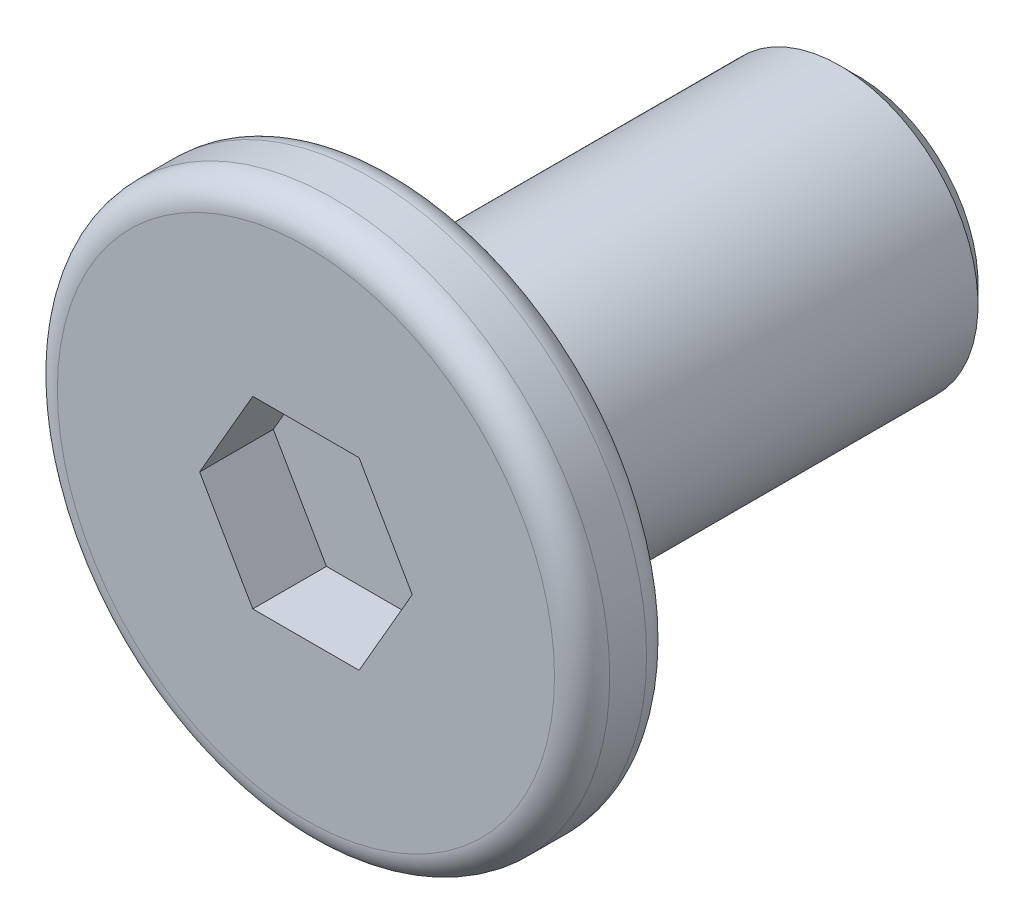
ISO-10303-21;
HEADER;
FILE_DESCRIPTION(('STEP AP214'),'2;1');
FILE_NAME('part.step','',(''),(''),'','','');
FILE_SCHEMA(('AUTOMOTIVE_DESIGN { 1 0 10303 214 1 1 1 1 }'));
ENDSEC;
DATA;
#1=APPLICATION_CONTEXT('core data for automotive mechanical design processes');
#2=APPLICATION_PROTOCOL_DEFINITION('international standard','automotive_design',2000,#1);
#3=PRODUCT_CONTEXT('',#1,'mechanical');
#4=PRODUCT('Part','Part','',(#3));
#5=PRODUCT_RELATED_PRODUCT_CATEGORY('part','',(#4));
#6=PRODUCT_DEFINITION_FORMATION('','',#4);
#7=PRODUCT_DEFINITION_CONTEXT('part definition',#1,'design');
#8=PRODUCT_DEFINITION('design','',#6,#7);
#9=PRODUCT_DEFINITION_SHAPE('','',#8);
#10=(LENGTH_UNIT() NAMED_UNIT(*) SI_UNIT(.MILLI.,.METRE.));
#11=(NAMED_UNIT(*) PLANE_ANGLE_UNIT() SI_UNIT($,.RADIAN.));
#12=(NAMED_UNIT(*) SI_UNIT($,.STERADIAN.) SOLID_ANGLE_UNIT());
#13=UNCERTAINTY_MEASURE_WITH_UNIT(LENGTH_MEASURE(1.E-05),#10,'distance_accuracy_value','');
#14=(GEOMETRIC_REPRESENTATION_CONTEXT(3) GLOBAL_UNCERTAINTY_ASSIGNED_CONTEXT((#13)) GLOBAL_UNIT_ASSIGNED_CONTEXT((#10,
#11,#12)) REPRESENTATION_CONTEXT('',''));
#15=CARTESIAN_POINT('',(0.,0.,0.));
#16=DIRECTION('',(0.,0.,1.));
#17=DIRECTION('',(1.,0.,0.));
#18=AXIS2_PLACEMENT_3D('',#15,#16,#17);
#19=CARTESIAN_POINT('',(0.,0.,0.5));
#20=DIRECTION('',(0.,0.,-1.));
#21=DIRECTION('',(-1.,0.,0.));
#22=AXIS2_PLACEMENT_3D('',#19,#20,#21);
#23=CYLINDRICAL_SURFACE('',#22,3.);
#24=CARTESIAN_POINT('',(0.,0.,-0.2));
#25=DIRECTION('',(0.,0.,1.));
#26=DIRECTION('',(1.,0.,0.));
#27=AXIS2_PLACEMENT_3D('',#24,#25,#26);
#28=CIRCLE('',#27,3.);
#29=CARTESIAN_POINT('',(3.,0.,-0.2));
#30=VERTEX_POINT('',#29);
#31=EDGE_CURVE('E153',#30,#30,#28,.T.);
#32=ORIENTED_EDGE('',*,*,#31,.T.);
#33=EDGE_LOOP('',(#32));
#34=FACE_BOUND('',#33,.T.);
#35=CARTESIAN_POINT('',(0.,0.,0.2));
#36=DIRECTION('',(0.,0.,1.));
#37=DIRECTION('',(1.,0.,0.));
#38=AXIS2_PLACEMENT_3D('',#35,#36,#37);
#39=CIRCLE('',#38,3.);
#40=CARTESIAN_POINT('',(3.,0.,0.2));
#41=VERTEX_POINT('',#40);
#42=EDGE_CURVE('E150',#41,#41,#39,.F.);
#43=ORIENTED_EDGE('',*,*,#42,.T.);
#44=EDGE_LOOP('',(#43));
#45=FACE_BOUND('',#44,.T.);
#46=ADVANCED_FACE('F34',(#34,#45),#23,.T.);
#47=CARTESIAN_POINT('',(0.,0.,0.5));
#48=DIRECTION('',(0.,0.,1.));
#49=DIRECTION('',(1.,0.,0.));
#50=AXIS2_PLACEMENT_3D('',#47,#48,#49);
#51=PLANE('',#50);
#52=CARTESIAN_POINT('',(0.,0.,0.5));
#53=DIRECTION('',(0.,0.,1.));
#54=DIRECTION('',(1.,0.,0.));
#55=AXIS2_PLACEMENT_3D('',#52,#53,#54);
#56=CIRCLE('',#55,2.7);
#57=CARTESIAN_POINT('',(2.7,0.,0.5));
#58=VERTEX_POINT('',#57);
#59=EDGE_CURVE('E11',#58,#58,#56,.T.);
#60=ORIENTED_EDGE('',*,*,#59,.T.);
#61=EDGE_LOOP('',(#60));
#62=FACE_BOUND('',#61,.T.);
#63=DIRECTION('',(0.5,0.866025403784439,0.));
#64=VECTOR('',#63,1.);
#65=CARTESIAN_POINT('',(0.577350269189626,-1.,0.5));
#66=LINE('',#65,#64);
#67=CARTESIAN_POINT('',(0.577350269189626,-1.,0.5));
#68=VERTEX_POINT('',#67);
#69=CARTESIAN_POINT('',(1.15470053837925,0.,0.5));
#70=VERTEX_POINT('',#69);
#71=EDGE_CURVE('E49',#68,#70,#66,.T.);
#72=ORIENTED_EDGE('',*,*,#71,.F.);
#73=DIRECTION('',(1.,0.,0.));
#74=VECTOR('',#73,1.);
#75=CARTESIAN_POINT('',(-0.577350269189625,-1.,0.5));
#76=LINE('',#75,#74);
#77=CARTESIAN_POINT('',(-0.577350269189625,-1.,0.5));
#78=VERTEX_POINT('',#77);
#79=EDGE_CURVE('E132',#78,#68,#76,.T.);
#80=ORIENTED_EDGE('',*,*,#79,.F.);
#81=DIRECTION('',(0.5,-0.866025403784438,0.));
#82=VECTOR('',#81,1.);
#83=CARTESIAN_POINT('',(-1.15470053837925,0.,0.5));
#84=LINE('',#83,#82);
#85=CARTESIAN_POINT('',(-1.15470053837925,0.,0.5));
#86=VERTEX_POINT('',#85);
#87=EDGE_CURVE('E130',#86,#78,#84,.T.);
#88=ORIENTED_EDGE('',*,*,#87,.F.);
#89=DIRECTION('',(-0.5,-0.866025403784438,0.));
#90=VECTOR('',#89,1.);
#91=CARTESIAN_POINT('',(-0.577350269189626,1.,0.5));
#92=LINE('',#91,#90);
#93=CARTESIAN_POINT('',(-0.577350269189626,1.,0.5));
#94=VERTEX_POINT('',#93);
#95=EDGE_CURVE('E97',#94,#86,#92,.T.);
#96=ORIENTED_EDGE('',*,*,#95,.F.);
#97=DIRECTION('',(-1.,0.,0.));
#98=VECTOR('',#97,1.);
#99=CARTESIAN_POINT('',(0.577350269189625,1.,0.5));
#100=LINE('',#99,#98);
#101=CARTESIAN_POINT('',(0.577350269189625,1.,0.5));
#102=VERTEX_POINT('',#101);
#103=EDGE_CURVE('E126',#102,#94,#100,.T.);
#104=ORIENTED_EDGE('',*,*,#103,.F.);
#105=DIRECTION('',(-0.5,0.866025403784438,0.));
#106=VECTOR('',#105,1.);
#107=CARTESIAN_POINT('',(1.15470053837925,0.,0.5));
#108=LINE('',#107,#106);
#109=EDGE_CURVE('E123',#70,#102,#108,.T.);
#110=ORIENTED_EDGE('',*,*,#109,.F.);
#111=EDGE_LOOP('',(#72,#80,#88,#96,#104,#110));
#112=FACE_BOUND('',#111,.T.);
#113=ADVANCED_FACE('F168',(#62,#112),#51,.T.);
#114=CARTESIAN_POINT('',(0.,0.,-0.5));
#115=DIRECTION('',(0.,0.,1.));
#116=DIRECTION('',(1.,0.,0.));
#117=AXIS2_PLACEMENT_3D('',#114,#115,#116);
#118=PLANE('',#117);
#119=CARTESIAN_POINT('',(0.,0.,-0.5));
#120=DIRECTION('',(0.,0.,1.));
#121=DIRECTION('',(1.,0.,0.));
#122=AXIS2_PLACEMENT_3D('',#119,#120,#121);
#123=CIRCLE('',#122,2.7);
#124=CARTESIAN_POINT('',(2.7,0.,-0.5));
#125=VERTEX_POINT('',#124);
#126=EDGE_CURVE('E42',#125,#125,#123,.F.);
#127=ORIENTED_EDGE('',*,*,#126,.T.);
#128=EDGE_LOOP('',(#127));
#129=FACE_BOUND('',#128,.T.);
#130=CARTESIAN_POINT('',(0.,0.,-0.5));
#131=DIRECTION('',(0.,0.,-1.));
#132=DIRECTION('',(-1.,0.,0.));
#133=AXIS2_PLACEMENT_3D('',#130,#131,#132);
#134=CIRCLE('',#133,1.5);
#135=CARTESIAN_POINT('',(-1.5,0.,-0.5));
#136=VERTEX_POINT('',#135);
#137=EDGE_CURVE('E136',#136,#136,#134,.T.);
#138=ORIENTED_EDGE('',*,*,#137,.F.);
#139=EDGE_LOOP('',(#138));
#140=FACE_BOUND('',#139,.T.);
#141=ADVANCED_FACE('F158',(#129,#140),#118,.F.);
#142=CARTESIAN_POINT('',(0.,0.,-5.5));
#143=DIRECTION('',(0.,0.,1.));
#144=DIRECTION('',(1.,0.,0.));
#145=AXIS2_PLACEMENT_3D('',#142,#143,#144);
#146=CYLINDRICAL_SURFACE('',#145,1.5);
#147=CARTESIAN_POINT('',(0.,0.,-5.3));
#148=DIRECTION('',(0.,0.,-1.));
#149=DIRECTION('',(-1.,0.,0.));
#150=AXIS2_PLACEMENT_3D('',#147,#148,#149);
#151=CIRCLE('',#150,1.5);
#152=CARTESIAN_POINT('',(-1.5,0.,-5.3));
#153=VERTEX_POINT('',#152);
#154=EDGE_CURVE('E147',#153,#153,#151,.F.);
#155=ORIENTED_EDGE('',*,*,#154,.T.);
#156=EDGE_LOOP('',(#155));
#157=FACE_BOUND('',#156,.T.);
#158=ORIENTED_EDGE('',*,*,#137,.T.);
#159=EDGE_LOOP('',(#158));
#160=FACE_BOUND('',#159,.T.);
#161=ADVANCED_FACE('F203',(#157,#160),#146,.T.);
#162=CARTESIAN_POINT('',(0.,0.,-5.5));
#163=DIRECTION('',(0.,0.,-1.));
#164=DIRECTION('',(-1.,0.,0.));
#165=AXIS2_PLACEMENT_3D('',#162,#163,#164);
#166=PLANE('',#165);
#167=CARTESIAN_POINT('',(0.,0.,-5.5));
#168=DIRECTION('',(0.,0.,-1.));
#169=DIRECTION('',(-1.,0.,0.));
#170=AXIS2_PLACEMENT_3D('',#167,#168,#169);
#171=CIRCLE('',#170,1.3);
#172=CARTESIAN_POINT('',(-1.3,0.,-5.5));
#173=VERTEX_POINT('',#172);
#174=EDGE_CURVE('E144',#173,#173,#171,.T.);
#175=ORIENTED_EDGE('',*,*,#174,.T.);
#176=EDGE_LOOP('',(#175));
#177=FACE_BOUND('',#176,.T.);
#178=ADVANCED_FACE('F195',(#177),#166,.T.);
#179=CARTESIAN_POINT('',(0.,0.,-5.5));
#180=DIRECTION('',(0.,0.,1.));
#181=DIRECTION('',(1.,0.,0.));
#182=AXIS2_PLACEMENT_3D('',#179,#180,#181);
#183=CONICAL_SURFACE('',#182,1.3,0.785398163397448);
#184=ORIENTED_EDGE('',*,*,#154,.F.);
#185=EDGE_LOOP('',(#184));
#186=FACE_BOUND('',#185,.T.);
#187=ORIENTED_EDGE('',*,*,#174,.F.);
#188=EDGE_LOOP('',(#187));
#189=FACE_BOUND('',#188,.T.);
#190=ADVANCED_FACE('F188',(#186,#189),#183,.T.);
#191=CARTESIAN_POINT('',(0.577350269189626,-1.,-0.3));
#192=DIRECTION('',(0.866025403784439,-0.5,0.));
#193=DIRECTION('',(0.5,0.866025403784439,0.));
#194=AXIS2_PLACEMENT_3D('',#191,#192,#193);
#195=PLANE('',#194);
#196=ORIENTED_EDGE('',*,*,#71,.T.);
#197=DIRECTION('',(0.,0.,1.));
#198=VECTOR('',#197,1.);
#199=CARTESIAN_POINT('',(1.15470053837925,0.,-0.3));
#200=LINE('',#199,#198);
#201=CARTESIAN_POINT('',(1.15470053837925,0.,-0.3));
#202=VERTEX_POINT('',#201);
#203=EDGE_CURVE('E79',#202,#70,#200,.T.);
#204=ORIENTED_EDGE('',*,*,#203,.F.);
#205=DIRECTION('',(0.5,0.866025403784439,0.));
#206=VECTOR('',#205,1.);
#207=CARTESIAN_POINT('',(0.577350269189626,-1.,-0.3));
#208=LINE('',#207,#206);
#209=CARTESIAN_POINT('',(0.577350269189626,-1.,-0.3));
#210=VERTEX_POINT('',#209);
#211=EDGE_CURVE('E134',#210,#202,#208,.T.);
#212=ORIENTED_EDGE('',*,*,#211,.F.);
#213=DIRECTION('',(0.,0.,1.));
#214=VECTOR('',#213,1.);
#215=CARTESIAN_POINT('',(0.577350269189626,-1.,-0.3));
#216=LINE('',#215,#214);
#217=EDGE_CURVE('E57',#210,#68,#216,.T.);
#218=ORIENTED_EDGE('',*,*,#217,.T.);
#219=EDGE_LOOP('',(#196,#204,#212,#218));
#220=FACE_BOUND('',#219,.T.);
#221=ADVANCED_FACE('F185',(#220),#195,.F.);
#222=CARTESIAN_POINT('',(-0.577350269189625,-1.,-0.3));
#223=DIRECTION('',(0.,-1.,0.));
#224=DIRECTION('',(1.,0.,0.));
#225=AXIS2_PLACEMENT_3D('',#222,#223,#224);
#226=PLANE('',#225);
#227=ORIENTED_EDGE('',*,*,#79,.T.);
#228=ORIENTED_EDGE('',*,*,#217,.F.);
#229=DIRECTION('',(1.,0.,0.));
#230=VECTOR('',#229,1.);
#231=CARTESIAN_POINT('',(-0.577350269189625,-1.,-0.3));
#232=LINE('',#231,#230);
#233=CARTESIAN_POINT('',(-0.577350269189625,-1.,-0.3));
#234=VERTEX_POINT('',#233);
#235=EDGE_CURVE('E109',#234,#210,#232,.T.);
#236=ORIENTED_EDGE('',*,*,#235,.F.);
#237=DIRECTION('',(0.,0.,1.));
#238=VECTOR('',#237,1.);
#239=CARTESIAN_POINT('',(-0.577350269189625,-1.,-0.3));
#240=LINE('',#239,#238);
#241=EDGE_CURVE('E101',#234,#78,#240,.T.);
#242=ORIENTED_EDGE('',*,*,#241,.T.);
#243=EDGE_LOOP('',(#227,#228,#236,#242));
#244=FACE_BOUND('',#243,.T.);
#245=ADVANCED_FACE('F187',(#244),#226,.F.);
#246=CARTESIAN_POINT('',(-1.15470053837925,0.,-0.3));
#247=DIRECTION('',(-0.866025403784438,-0.5,0.));
#248=DIRECTION('',(0.5,-0.866025403784438,0.));
#249=AXIS2_PLACEMENT_3D('',#246,#247,#248);
#250=PLANE('',#249);
#251=ORIENTED_EDGE('',*,*,#87,.T.);
#252=ORIENTED_EDGE('',*,*,#241,.F.);
#253=DIRECTION('',(0.5,-0.866025403784438,0.));
#254=VECTOR('',#253,1.);
#255=CARTESIAN_POINT('',(-1.15470053837925,0.,-0.3));
#256=LINE('',#255,#254);
#257=CARTESIAN_POINT('',(-1.15470053837925,0.,-0.3));
#258=VERTEX_POINT('',#257);
#259=EDGE_CURVE('E105',#258,#234,#256,.T.);
#260=ORIENTED_EDGE('',*,*,#259,.F.);
#261=DIRECTION('',(0.,0.,1.));
#262=VECTOR('',#261,1.);
#263=CARTESIAN_POINT('',(-1.15470053837925,0.,-0.3));
#264=LINE('',#263,#262);
#265=EDGE_CURVE('E90',#258,#86,#264,.T.);
#266=ORIENTED_EDGE('',*,*,#265,.T.);
#267=EDGE_LOOP('',(#251,#252,#260,#266));
#268=FACE_BOUND('',#267,.T.);
#269=ADVANCED_FACE('F106',(#268),#250,.F.);
#270=CARTESIAN_POINT('',(-0.577350269189626,1.,-0.3));
#271=DIRECTION('',(-0.866025403784438,0.5,0.));
#272=DIRECTION('',(-0.5,-0.866025403784439,0.));
#273=AXIS2_PLACEMENT_3D('',#270,#271,#272);
#274=PLANE('',#273);
#275=ORIENTED_EDGE('',*,*,#95,.T.);
#276=ORIENTED_EDGE('',*,*,#265,.F.);
#277=DIRECTION('',(-0.5,-0.866025403784438,0.));
#278=VECTOR('',#277,1.);
#279=CARTESIAN_POINT('',(-0.577350269189626,1.,-0.3));
#280=LINE('',#279,#278);
#281=CARTESIAN_POINT('',(-0.577350269189626,1.,-0.3));
#282=VERTEX_POINT('',#281);
#283=EDGE_CURVE('E94',#282,#258,#280,.T.);
#284=ORIENTED_EDGE('',*,*,#283,.F.);
#285=DIRECTION('',(0.,0.,1.));
#286=VECTOR('',#285,1.);
#287=CARTESIAN_POINT('',(-0.577350269189626,1.,-0.3));
#288=LINE('',#287,#286);
#289=EDGE_CURVE('E102',#282,#94,#288,.T.);
#290=ORIENTED_EDGE('',*,*,#289,.T.);
#291=EDGE_LOOP('',(#275,#276,#284,#290));
#292=FACE_BOUND('',#291,.T.);
#293=ADVANCED_FACE('F92',(#292),#274,.F.);
#294=CARTESIAN_POINT('',(0.577350269189625,1.,-0.3));
#295=DIRECTION('',(0.,1.,0.));
#296=DIRECTION('',(0.,0.,1.));
#297=AXIS2_PLACEMENT_3D('',#294,#295,#296);
#298=PLANE('',#297);
#299=ORIENTED_EDGE('',*,*,#103,.T.);
#300=ORIENTED_EDGE('',*,*,#289,.F.);
#301=DIRECTION('',(-1.,0.,0.));
#302=VECTOR('',#301,1.);
#303=CARTESIAN_POINT('',(0.577350269189625,1.,-0.3));
#304=LINE('',#303,#302);
#305=CARTESIAN_POINT('',(0.577350269189625,1.,-0.3));
#306=VERTEX_POINT('',#305);
#307=EDGE_CURVE('E115',#306,#282,#304,.T.);
#308=ORIENTED_EDGE('',*,*,#307,.F.);
#309=DIRECTION('',(0.,0.,1.));
#310=VECTOR('',#309,1.);
#311=CARTESIAN_POINT('',(0.577350269189625,1.,-0.3));
#312=LINE('',#311,#310);
#313=EDGE_CURVE('E139',#306,#102,#312,.T.);
#314=ORIENTED_EDGE('',*,*,#313,.T.);
#315=EDGE_LOOP('',(#299,#300,#308,#314));
#316=FACE_BOUND('',#315,.T.);
#317=ADVANCED_FACE('F256',(#316),#298,.F.);
#318=CARTESIAN_POINT('',(1.15470053837925,0.,-0.3));
#319=DIRECTION('',(0.866025403784438,0.5,0.));
#320=DIRECTION('',(-0.5,0.866025403784439,0.));
#321=AXIS2_PLACEMENT_3D('',#318,#319,#320);
#322=PLANE('',#321);
#323=ORIENTED_EDGE('',*,*,#109,.T.);
#324=ORIENTED_EDGE('',*,*,#313,.F.);
#325=DIRECTION('',(-0.5,0.866025403784438,0.));
#326=VECTOR('',#325,1.);
#327=CARTESIAN_POINT('',(1.15470053837925,0.,-0.3));
#328=LINE('',#327,#326);
#329=EDGE_CURVE('E117',#202,#306,#328,.T.);
#330=ORIENTED_EDGE('',*,*,#329,.F.);
#331=ORIENTED_EDGE('',*,*,#203,.T.);
#332=EDGE_LOOP('',(#323,#324,#330,#331));
#333=FACE_BOUND('',#332,.T.);
#334=ADVANCED_FACE('F183',(#333),#322,.F.);
#335=CARTESIAN_POINT('',(0.,0.,-0.3));
#336=DIRECTION('',(0.,0.,1.));
#337=DIRECTION('',(1.,0.,0.));
#338=AXIS2_PLACEMENT_3D('',#335,#336,#337);
#339=PLANE('',#338);
#340=ORIENTED_EDGE('',*,*,#211,.T.);
#341=ORIENTED_EDGE('',*,*,#329,.T.);
#342=ORIENTED_EDGE('',*,*,#307,.T.);
#343=ORIENTED_EDGE('',*,*,#283,.T.);
#344=ORIENTED_EDGE('',*,*,#259,.T.);
#345=ORIENTED_EDGE('',*,*,#235,.T.);
#346=EDGE_LOOP('',(#340,#341,#342,#343,#344,#345));
#347=FACE_BOUND('',#346,.T.);
#348=ADVANCED_FACE('F112',(#347),#339,.T.);
#349=CARTESIAN_POINT('',(0.,0.,-0.2));
#350=DIRECTION('',(0.,0.,1.));
#351=DIRECTION('',(1.,0.,0.));
#352=AXIS2_PLACEMENT_3D('',#349,#350,#351);
#353=TOROIDAL_SURFACE('',#352,2.7,0.3);
#354=ORIENTED_EDGE('',*,*,#126,.F.);
#355=EDGE_LOOP('',(#354));
#356=FACE_BOUND('',#355,.T.);
#357=ORIENTED_EDGE('',*,*,#31,.F.);
#358=EDGE_LOOP('',(#357));
#359=FACE_BOUND('',#358,.T.);
#360=ADVANCED_FACE('F161',(#356,#359),#353,.T.);
#361=CARTESIAN_POINT('',(0.,0.,0.2));
#362=DIRECTION('',(0.,0.,1.));
#363=DIRECTION('',(1.,0.,0.));
#364=AXIS2_PLACEMENT_3D('',#361,#362,#363);
#365=TOROIDAL_SURFACE('',#364,2.7,0.3);
#366=ORIENTED_EDGE('',*,*,#42,.F.);
#367=EDGE_LOOP('',(#366));
#368=FACE_BOUND('',#367,.T.);
#369=ORIENTED_EDGE('',*,*,#59,.F.);
#370=EDGE_LOOP('',(#369));
#371=FACE_BOUND('',#370,.T.);
#372=ADVANCED_FACE('F36',(#368,#371),#365,.T.);
#373=CLOSED_SHELL('',(#46,#113,#141,#161,#178,#190,#221,#245,#269,#293,#317,#334,#348,#360,#372));
#374=MANIFOLD_SOLID_BREP('B2',#373);
#375=ADVANCED_BREP_SHAPE_REPRESENTATION('',(#18,#374),#14);
#376=SHAPE_DEFINITION_REPRESENTATION(#9,#375);
ENDSEC;
END-ISO-10303-21;
